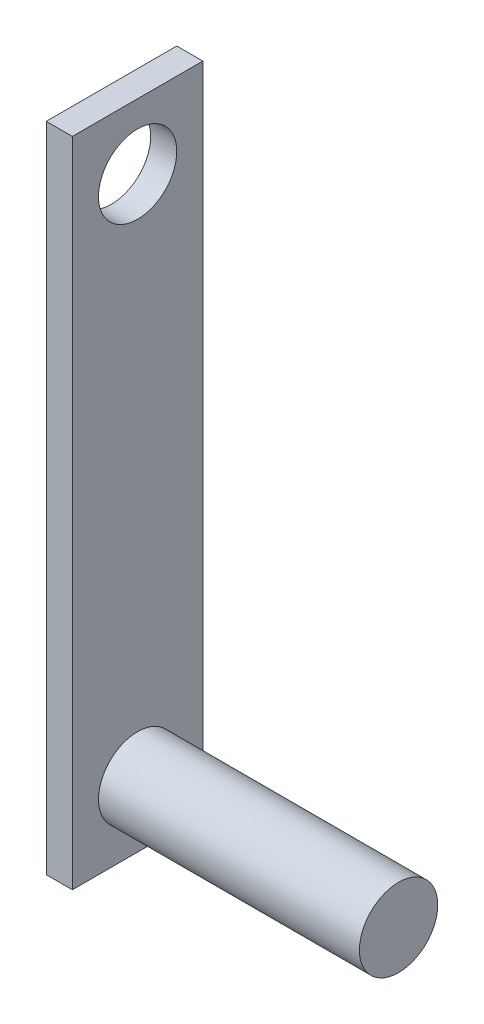
ISO-10303-21;
HEADER;
FILE_DESCRIPTION(('STEP AP214'),'2;1');
FILE_NAME('part.step','',(''),(''),'','','');
FILE_SCHEMA(('AUTOMOTIVE_DESIGN { 1 0 10303 214 1 1 1 1 }'));
ENDSEC;
DATA;
#1=APPLICATION_CONTEXT('core data for automotive mechanical design processes');
#2=APPLICATION_PROTOCOL_DEFINITION('international standard','automotive_design',2000,#1);
#3=PRODUCT_CONTEXT('',#1,'mechanical');
#4=PRODUCT('Part','Part','',(#3));
#5=PRODUCT_RELATED_PRODUCT_CATEGORY('part','',(#4));
#6=PRODUCT_DEFINITION_FORMATION('','',#4);
#7=PRODUCT_DEFINITION_CONTEXT('part definition',#1,'design');
#8=PRODUCT_DEFINITION('design','',#6,#7);
#9=PRODUCT_DEFINITION_SHAPE('','',#8);
#10=(LENGTH_UNIT() NAMED_UNIT(*) SI_UNIT(.MILLI.,.METRE.));
#11=(NAMED_UNIT(*) PLANE_ANGLE_UNIT() SI_UNIT($,.RADIAN.));
#12=(NAMED_UNIT(*) SI_UNIT($,.STERADIAN.) SOLID_ANGLE_UNIT());
#13=UNCERTAINTY_MEASURE_WITH_UNIT(LENGTH_MEASURE(1.E-05),#10,'distance_accuracy_value','');
#14=(GEOMETRIC_REPRESENTATION_CONTEXT(3) GLOBAL_UNCERTAINTY_ASSIGNED_CONTEXT((#13)) GLOBAL_UNIT_ASSIGNED_CONTEXT((#10,
#11,#12)) REPRESENTATION_CONTEXT('',''));
#15=CARTESIAN_POINT('',(0.,0.,0.));
#16=DIRECTION('',(0.,0.,1.));
#17=DIRECTION('',(1.,0.,0.));
#18=AXIS2_PLACEMENT_3D('',#15,#16,#17);
#19=CARTESIAN_POINT('',(2.,0.,0.));
#20=DIRECTION('',(-1.,0.,0.));
#21=DIRECTION('',(0.,0.,1.));
#22=AXIS2_PLACEMENT_3D('',#19,#20,#21);
#23=PLANE('',#22);
#24=DIRECTION('',(0.,1.,0.));
#25=VECTOR('',#24,1.);
#26=CARTESIAN_POINT('',(2.,-25.,-5.));
#27=LINE('',#26,#25);
#28=CARTESIAN_POINT('',(2.,-25.,-5.));
#29=VERTEX_POINT('',#28);
#30=CARTESIAN_POINT('',(2.,25.,-5.));
#31=VERTEX_POINT('',#30);
#32=EDGE_CURVE('E86',#29,#31,#27,.T.);
#33=ORIENTED_EDGE('',*,*,#32,.T.);
#34=DIRECTION('',(0.,0.,1.));
#35=VECTOR('',#34,1.);
#36=CARTESIAN_POINT('',(2.,25.,5.));
#37=LINE('',#36,#35);
#38=CARTESIAN_POINT('',(2.,25.,5.));
#39=VERTEX_POINT('',#38);
#40=EDGE_CURVE('E81',#31,#39,#37,.T.);
#41=ORIENTED_EDGE('',*,*,#40,.T.);
#42=DIRECTION('',(0.,-1.,0.));
#43=VECTOR('',#42,1.);
#44=CARTESIAN_POINT('',(2.,-25.,5.));
#45=LINE('',#44,#43);
#46=CARTESIAN_POINT('',(2.,-25.,5.));
#47=VERTEX_POINT('',#46);
#48=EDGE_CURVE('E84',#39,#47,#45,.T.);
#49=ORIENTED_EDGE('',*,*,#48,.T.);
#50=DIRECTION('',(0.,0.,-1.));
#51=VECTOR('',#50,1.);
#52=CARTESIAN_POINT('',(2.,-25.,5.));
#53=LINE('',#52,#51);
#54=EDGE_CURVE('E50',#47,#29,#53,.T.);
#55=ORIENTED_EDGE('',*,*,#54,.T.);
#56=EDGE_LOOP('',(#33,#41,#49,#55));
#57=FACE_BOUND('',#56,.T.);
#58=CARTESIAN_POINT('',(2.,20.,0.));
#59=DIRECTION('',(1.,0.,0.));
#60=DIRECTION('',(0.,0.,-1.));
#61=AXIS2_PLACEMENT_3D('',#58,#59,#60);
#62=CIRCLE('',#61,3.);
#63=CARTESIAN_POINT('',(2.,20.,-3.));
#64=VERTEX_POINT('',#63);
#65=EDGE_CURVE('E143',#64,#64,#62,.T.);
#66=ORIENTED_EDGE('',*,*,#65,.F.);
#67=EDGE_LOOP('',(#66));
#68=FACE_BOUND('',#67,.T.);
#69=CARTESIAN_POINT('',(2.,-20.,0.));
#70=DIRECTION('',(-1.,0.,0.));
#71=DIRECTION('',(0.,0.,1.));
#72=AXIS2_PLACEMENT_3D('',#69,#70,#71);
#73=CIRCLE('',#72,3.);
#74=CARTESIAN_POINT('',(2.,-20.,3.));
#75=VERTEX_POINT('',#74);
#76=EDGE_CURVE('E11',#75,#75,#73,.F.);
#77=ORIENTED_EDGE('',*,*,#76,.F.);
#78=EDGE_LOOP('',(#77));
#79=FACE_BOUND('',#78,.T.);
#80=ADVANCED_FACE('F33',(#57,#68,#79),#23,.F.);
#81=CARTESIAN_POINT('',(2.,-25.,-5.));
#82=DIRECTION('',(0.,0.,1.));
#83=DIRECTION('',(1.,0.,0.));
#84=AXIS2_PLACEMENT_3D('',#81,#82,#83);
#85=PLANE('',#84);
#86=DIRECTION('',(0.,1.,0.));
#87=VECTOR('',#86,1.);
#88=CARTESIAN_POINT('',(0.,-25.,-5.));
#89=LINE('',#88,#87);
#90=CARTESIAN_POINT('',(0.,-25.,-5.));
#91=VERTEX_POINT('',#90);
#92=CARTESIAN_POINT('',(0.,25.,-5.));
#93=VERTEX_POINT('',#92);
#94=EDGE_CURVE('E100',#91,#93,#89,.T.);
#95=ORIENTED_EDGE('',*,*,#94,.T.);
#96=DIRECTION('',(-1.,0.,0.));
#97=VECTOR('',#96,1.);
#98=CARTESIAN_POINT('',(2.,25.,-5.));
#99=LINE('',#98,#97);
#100=EDGE_CURVE('E42',#31,#93,#99,.T.);
#101=ORIENTED_EDGE('',*,*,#100,.F.);
#102=ORIENTED_EDGE('',*,*,#32,.F.);
#103=DIRECTION('',(-1.,0.,0.));
#104=VECTOR('',#103,1.);
#105=CARTESIAN_POINT('',(2.,-25.,-5.));
#106=LINE('',#105,#104);
#107=EDGE_CURVE('E96',#29,#91,#106,.T.);
#108=ORIENTED_EDGE('',*,*,#107,.T.);
#109=EDGE_LOOP('',(#95,#101,#102,#108));
#110=FACE_BOUND('',#109,.T.);
#111=ADVANCED_FACE('F35',(#110),#85,.F.);
#112=CARTESIAN_POINT('',(2.,25.,5.));
#113=DIRECTION('',(0.,-1.,0.));
#114=DIRECTION('',(0.,0.,-1.));
#115=AXIS2_PLACEMENT_3D('',#112,#113,#114);
#116=PLANE('',#115);
#117=DIRECTION('',(0.,0.,1.));
#118=VECTOR('',#117,1.);
#119=CARTESIAN_POINT('',(0.,25.,5.));
#120=LINE('',#119,#118);
#121=CARTESIAN_POINT('',(0.,25.,5.));
#122=VERTEX_POINT('',#121);
#123=EDGE_CURVE('E91',#93,#122,#120,.T.);
#124=ORIENTED_EDGE('',*,*,#123,.T.);
#125=DIRECTION('',(-1.,0.,0.));
#126=VECTOR('',#125,1.);
#127=CARTESIAN_POINT('',(2.,25.,5.));
#128=LINE('',#127,#126);
#129=EDGE_CURVE('E89',#39,#122,#128,.T.);
#130=ORIENTED_EDGE('',*,*,#129,.F.);
#131=ORIENTED_EDGE('',*,*,#40,.F.);
#132=ORIENTED_EDGE('',*,*,#100,.T.);
#133=EDGE_LOOP('',(#124,#130,#131,#132));
#134=FACE_BOUND('',#133,.T.);
#135=ADVANCED_FACE('F90',(#134),#116,.F.);
#136=CARTESIAN_POINT('',(2.,-25.,5.));
#137=DIRECTION('',(0.,0.,-1.));
#138=DIRECTION('',(-1.,0.,0.));
#139=AXIS2_PLACEMENT_3D('',#136,#137,#138);
#140=PLANE('',#139);
#141=DIRECTION('',(0.,-1.,0.));
#142=VECTOR('',#141,1.);
#143=CARTESIAN_POINT('',(0.,-25.,5.));
#144=LINE('',#143,#142);
#145=CARTESIAN_POINT('',(0.,-25.,5.));
#146=VERTEX_POINT('',#145);
#147=EDGE_CURVE('E67',#122,#146,#144,.T.);
#148=ORIENTED_EDGE('',*,*,#147,.T.);
#149=DIRECTION('',(-1.,0.,0.));
#150=VECTOR('',#149,1.);
#151=CARTESIAN_POINT('',(2.,-25.,5.));
#152=LINE('',#151,#150);
#153=EDGE_CURVE('E92',#47,#146,#152,.T.);
#154=ORIENTED_EDGE('',*,*,#153,.F.);
#155=ORIENTED_EDGE('',*,*,#48,.F.);
#156=ORIENTED_EDGE('',*,*,#129,.T.);
#157=EDGE_LOOP('',(#148,#154,#155,#156));
#158=FACE_BOUND('',#157,.T.);
#159=ADVANCED_FACE('F94',(#158),#140,.F.);
#160=CARTESIAN_POINT('',(2.,-25.,5.));
#161=DIRECTION('',(0.,1.,0.));
#162=DIRECTION('',(0.,0.,1.));
#163=AXIS2_PLACEMENT_3D('',#160,#161,#162);
#164=PLANE('',#163);
#165=DIRECTION('',(0.,0.,-1.));
#166=VECTOR('',#165,1.);
#167=CARTESIAN_POINT('',(0.,-25.,5.));
#168=LINE('',#167,#166);
#169=EDGE_CURVE('E73',#146,#91,#168,.T.);
#170=ORIENTED_EDGE('',*,*,#169,.T.);
#171=ORIENTED_EDGE('',*,*,#107,.F.);
#172=ORIENTED_EDGE('',*,*,#54,.F.);
#173=ORIENTED_EDGE('',*,*,#153,.T.);
#174=EDGE_LOOP('',(#170,#171,#172,#173));
#175=FACE_BOUND('',#174,.T.);
#176=ADVANCED_FACE('F114',(#175),#164,.F.);
#177=CARTESIAN_POINT('',(0.,0.,0.));
#178=DIRECTION('',(-1.,0.,0.));
#179=DIRECTION('',(0.,0.,1.));
#180=AXIS2_PLACEMENT_3D('',#177,#178,#179);
#181=PLANE('',#180);
#182=CARTESIAN_POINT('',(0.,20.,0.));
#183=DIRECTION('',(-1.,0.,0.));
#184=DIRECTION('',(0.,0.,1.));
#185=AXIS2_PLACEMENT_3D('',#182,#183,#184);
#186=CIRCLE('',#185,3.);
#187=CARTESIAN_POINT('',(0.,20.,3.));
#188=VERTEX_POINT('',#187);
#189=EDGE_CURVE('E103',#188,#188,#186,.F.);
#190=ORIENTED_EDGE('',*,*,#189,.T.);
#191=EDGE_LOOP('',(#190));
#192=FACE_BOUND('',#191,.T.);
#193=ORIENTED_EDGE('',*,*,#94,.F.);
#194=ORIENTED_EDGE('',*,*,#169,.F.);
#195=ORIENTED_EDGE('',*,*,#147,.F.);
#196=ORIENTED_EDGE('',*,*,#123,.F.);
#197=EDGE_LOOP('',(#193,#194,#195,#196));
#198=FACE_BOUND('',#197,.T.);
#199=ADVANCED_FACE('F111',(#192,#198),#181,.T.);
#200=CARTESIAN_POINT('',(-8.48528137423857,20.,0.));
#201=DIRECTION('',(1.,0.,0.));
#202=DIRECTION('',(0.,0.,-1.));
#203=AXIS2_PLACEMENT_3D('',#200,#201,#202);
#204=CYLINDRICAL_SURFACE('',#203,3.);
#205=ORIENTED_EDGE('',*,*,#65,.T.);
#206=EDGE_LOOP('',(#205));
#207=FACE_BOUND('',#206,.T.);
#208=ORIENTED_EDGE('',*,*,#189,.F.);
#209=EDGE_LOOP('',(#208));
#210=FACE_BOUND('',#209,.T.);
#211=ADVANCED_FACE('F113',(#207,#210),#204,.F.);
#212=CARTESIAN_POINT('',(22.,-20.,0.));
#213=DIRECTION('',(-1.,0.,0.));
#214=DIRECTION('',(0.,0.,1.));
#215=AXIS2_PLACEMENT_3D('',#212,#213,#214);
#216=CYLINDRICAL_SURFACE('',#215,3.);
#217=CARTESIAN_POINT('',(22.,-20.,0.));
#218=DIRECTION('',(1.,0.,0.));
#219=DIRECTION('',(0.,0.,-1.));
#220=AXIS2_PLACEMENT_3D('',#217,#218,#219);
#221=CIRCLE('',#220,3.);
#222=CARTESIAN_POINT('',(22.,-20.,-3.));
#223=VERTEX_POINT('',#222);
#224=EDGE_CURVE('E142',#223,#223,#221,.T.);
#225=ORIENTED_EDGE('',*,*,#224,.F.);
#226=EDGE_LOOP('',(#225));
#227=FACE_BOUND('',#226,.T.);
#228=ORIENTED_EDGE('',*,*,#76,.T.);
#229=EDGE_LOOP('',(#228));
#230=FACE_BOUND('',#229,.T.);
#231=ADVANCED_FACE('F121',(#227,#230),#216,.T.);
#232=CARTESIAN_POINT('',(22.,-20.,0.));
#233=DIRECTION('',(1.,0.,0.));
#234=DIRECTION('',(0.,0.,-1.));
#235=AXIS2_PLACEMENT_3D('',#232,#233,#234);
#236=PLANE('',#235);
#237=ORIENTED_EDGE('',*,*,#224,.T.);
#238=EDGE_LOOP('',(#237));
#239=FACE_BOUND('',#238,.T.);
#240=ADVANCED_FACE('F134',(#239),#236,.T.);
#241=CLOSED_SHELL('',(#80,#111,#135,#159,#176,#199,#211,#231,#240));
#242=MANIFOLD_SOLID_BREP('B2',#241);
#243=ADVANCED_BREP_SHAPE_REPRESENTATION('',(#18,#242),#14);
#244=SHAPE_DEFINITION_REPRESENTATION(#9,#243);
ENDSEC;
END-ISO-10303-21;
